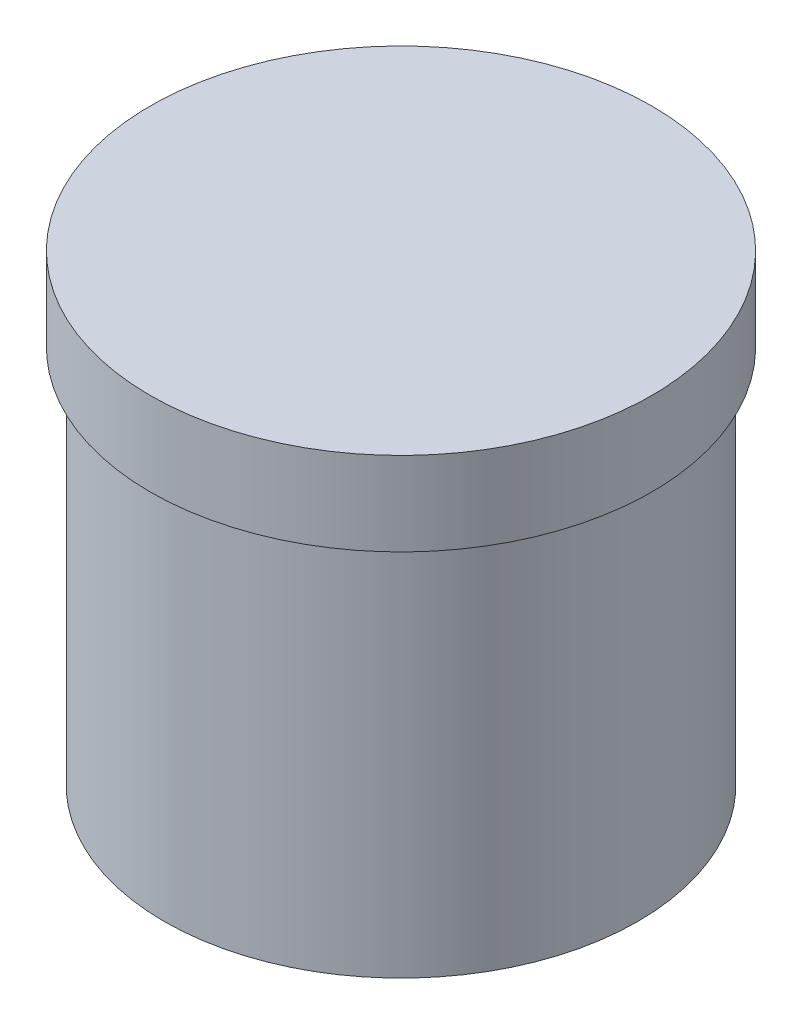
ISO-10303-21;
HEADER;
FILE_DESCRIPTION(('STEP AP214'),'2;1');
FILE_NAME('part.step','',(''),(''),'','','');
FILE_SCHEMA(('AUTOMOTIVE_DESIGN { 1 0 10303 214 1 1 1 1 }'));
ENDSEC;
DATA;
#1=APPLICATION_CONTEXT('core data for automotive mechanical design processes');
#2=APPLICATION_PROTOCOL_DEFINITION('international standard','automotive_design',2000,#1);
#3=PRODUCT_CONTEXT('',#1,'mechanical');
#4=PRODUCT('Part','Part','',(#3));
#5=PRODUCT_RELATED_PRODUCT_CATEGORY('part','',(#4));
#6=PRODUCT_DEFINITION_FORMATION('','',#4);
#7=PRODUCT_DEFINITION_CONTEXT('part definition',#1,'design');
#8=PRODUCT_DEFINITION('design','',#6,#7);
#9=PRODUCT_DEFINITION_SHAPE('','',#8);
#10=(LENGTH_UNIT() NAMED_UNIT(*) SI_UNIT(.MILLI.,.METRE.));
#11=(NAMED_UNIT(*) PLANE_ANGLE_UNIT() SI_UNIT($,.RADIAN.));
#12=(NAMED_UNIT(*) SI_UNIT($,.STERADIAN.) SOLID_ANGLE_UNIT());
#13=UNCERTAINTY_MEASURE_WITH_UNIT(LENGTH_MEASURE(1.E-05),#10,'distance_accuracy_value','');
#14=(GEOMETRIC_REPRESENTATION_CONTEXT(3) GLOBAL_UNCERTAINTY_ASSIGNED_CONTEXT((#13)) GLOBAL_UNIT_ASSIGNED_CONTEXT((#10,
#11,#12)) REPRESENTATION_CONTEXT('',''));
#15=CARTESIAN_POINT('',(0.,0.,0.));
#16=DIRECTION('',(0.,0.,1.));
#17=DIRECTION('',(1.,0.,0.));
#18=AXIS2_PLACEMENT_3D('',#15,#16,#17);
#19=CARTESIAN_POINT('',(0.,68.,0.));
#20=DIRECTION('',(0.,-1.,0.));
#21=DIRECTION('',(0.,0.,-1.));
#22=AXIS2_PLACEMENT_3D('',#19,#20,#21);
#23=CYLINDRICAL_SURFACE('',#22,42.5);
#24=CARTESIAN_POINT('',(0.,68.,0.));
#25=DIRECTION('',(0.,1.,0.));
#26=DIRECTION('',(0.,0.,1.));
#27=AXIS2_PLACEMENT_3D('',#24,#25,#26);
#28=CIRCLE('',#27,42.5);
#29=CARTESIAN_POINT('',(0.,68.,42.5));
#30=VERTEX_POINT('',#29);
#31=EDGE_CURVE('E10',#30,#30,#28,.T.);
#32=ORIENTED_EDGE('',*,*,#31,.F.);
#33=EDGE_LOOP('',(#32));
#34=FACE_BOUND('',#33,.T.);
#35=CARTESIAN_POINT('',(0.,0.,0.));
#36=DIRECTION('',(0.,1.,0.));
#37=DIRECTION('',(0.,0.,1.));
#38=AXIS2_PLACEMENT_3D('',#35,#36,#37);
#39=CIRCLE('',#38,42.5);
#40=CARTESIAN_POINT('',(0.,0.,42.5));
#41=VERTEX_POINT('',#40);
#42=EDGE_CURVE('E44',#41,#41,#39,.T.);
#43=ORIENTED_EDGE('',*,*,#42,.T.);
#44=EDGE_LOOP('',(#43));
#45=FACE_BOUND('',#44,.T.);
#46=ADVANCED_FACE('F41',(#34,#45),#23,.T.);
#47=CARTESIAN_POINT('',(0.,0.,0.));
#48=DIRECTION('',(0.,1.,0.));
#49=DIRECTION('',(0.,0.,1.));
#50=AXIS2_PLACEMENT_3D('',#47,#48,#49);
#51=PLANE('',#50);
#52=ORIENTED_EDGE('',*,*,#42,.F.);
#53=EDGE_LOOP('',(#52));
#54=FACE_BOUND('',#53,.T.);
#55=ADVANCED_FACE('F68',(#54),#51,.F.);
#56=CARTESIAN_POINT('',(0.,83.,0.));
#57=DIRECTION('',(0.,-1.,0.));
#58=DIRECTION('',(0.,0.,-1.));
#59=AXIS2_PLACEMENT_3D('',#56,#57,#58);
#60=CYLINDRICAL_SURFACE('',#59,45.);
#61=CARTESIAN_POINT('',(0.,83.,0.));
#62=DIRECTION('',(0.,1.,0.));
#63=DIRECTION('',(0.,0.,1.));
#64=AXIS2_PLACEMENT_3D('',#61,#62,#63);
#65=CIRCLE('',#64,45.);
#66=CARTESIAN_POINT('',(0.,83.,45.));
#67=VERTEX_POINT('',#66);
#68=EDGE_CURVE('E53',#67,#67,#65,.T.);
#69=ORIENTED_EDGE('',*,*,#68,.F.);
#70=EDGE_LOOP('',(#69));
#71=FACE_BOUND('',#70,.T.);
#72=CARTESIAN_POINT('',(0.,68.,0.));
#73=DIRECTION('',(0.,1.,0.));
#74=DIRECTION('',(0.,0.,1.));
#75=AXIS2_PLACEMENT_3D('',#72,#73,#74);
#76=CIRCLE('',#75,45.);
#77=CARTESIAN_POINT('',(0.,68.,45.));
#78=VERTEX_POINT('',#77);
#79=EDGE_CURVE('E55',#78,#78,#76,.T.);
#80=ORIENTED_EDGE('',*,*,#79,.T.);
#81=EDGE_LOOP('',(#80));
#82=FACE_BOUND('',#81,.T.);
#83=ADVANCED_FACE('F65',(#71,#82),#60,.T.);
#84=CARTESIAN_POINT('',(0.,83.,0.));
#85=DIRECTION('',(0.,1.,0.));
#86=DIRECTION('',(0.,0.,1.));
#87=AXIS2_PLACEMENT_3D('',#84,#85,#86);
#88=PLANE('',#87);
#89=ORIENTED_EDGE('',*,*,#68,.T.);
#90=EDGE_LOOP('',(#89));
#91=FACE_BOUND('',#90,.T.);
#92=ADVANCED_FACE('F63',(#91),#88,.T.);
#93=CARTESIAN_POINT('',(0.,68.,0.));
#94=DIRECTION('',(0.,1.,0.));
#95=DIRECTION('',(0.,0.,1.));
#96=AXIS2_PLACEMENT_3D('',#93,#94,#95);
#97=PLANE('',#96);
#98=ORIENTED_EDGE('',*,*,#31,.T.);
#99=EDGE_LOOP('',(#98));
#100=FACE_BOUND('',#99,.T.);
#101=ORIENTED_EDGE('',*,*,#79,.F.);
#102=EDGE_LOOP('',(#101));
#103=FACE_BOUND('',#102,.T.);
#104=ADVANCED_FACE('F72',(#100,#103),#97,.F.);
#105=CLOSED_SHELL('',(#46,#55,#83,#92,#104));
#106=MANIFOLD_SOLID_BREP('B2',#105);
#107=ADVANCED_BREP_SHAPE_REPRESENTATION('',(#18,#106),#14);
#108=SHAPE_DEFINITION_REPRESENTATION(#9,#107);
ENDSEC;
END-ISO-10303-21;
